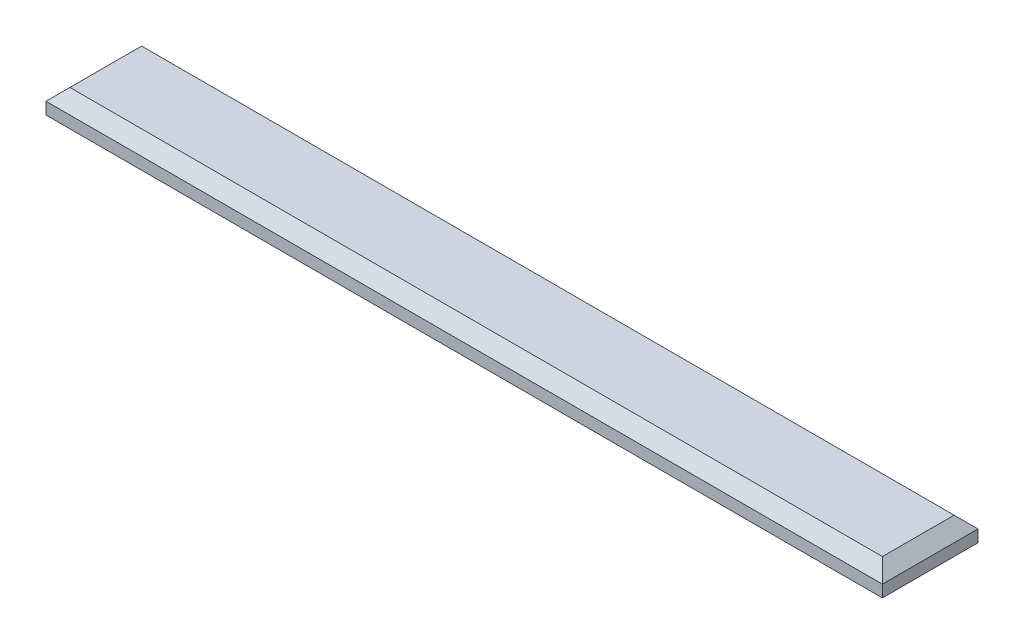
ISO-10303-21;
HEADER;
FILE_DESCRIPTION(('STEP AP214'),'2;1');
FILE_NAME('part.step','',(''),(''),'','','');
FILE_SCHEMA(('AUTOMOTIVE_DESIGN { 1 0 10303 214 1 1 1 1 }'));
ENDSEC;
DATA;
#1=APPLICATION_CONTEXT('core data for automotive mechanical design processes');
#2=APPLICATION_PROTOCOL_DEFINITION('international standard','automotive_design',2000,#1);
#3=PRODUCT_CONTEXT('',#1,'mechanical');
#4=PRODUCT('Part','Part','',(#3));
#5=PRODUCT_RELATED_PRODUCT_CATEGORY('part','',(#4));
#6=PRODUCT_DEFINITION_FORMATION('','',#4);
#7=PRODUCT_DEFINITION_CONTEXT('part definition',#1,'design');
#8=PRODUCT_DEFINITION('design','',#6,#7);
#9=PRODUCT_DEFINITION_SHAPE('','',#8);
#10=(LENGTH_UNIT() NAMED_UNIT(*) SI_UNIT(.MILLI.,.METRE.));
#11=(NAMED_UNIT(*) PLANE_ANGLE_UNIT() SI_UNIT($,.RADIAN.));
#12=(NAMED_UNIT(*) SI_UNIT($,.STERADIAN.) SOLID_ANGLE_UNIT());
#13=UNCERTAINTY_MEASURE_WITH_UNIT(LENGTH_MEASURE(1.E-05),#10,'distance_accuracy_value','');
#14=(GEOMETRIC_REPRESENTATION_CONTEXT(3) GLOBAL_UNCERTAINTY_ASSIGNED_CONTEXT((#13)) GLOBAL_UNIT_ASSIGNED_CONTEXT((#10,
#11,#12)) REPRESENTATION_CONTEXT('',''));
#15=CARTESIAN_POINT('',(0.,0.,0.));
#16=DIRECTION('',(0.,0.,1.));
#17=DIRECTION('',(1.,0.,0.));
#18=AXIS2_PLACEMENT_3D('',#15,#16,#17);
#19=CARTESIAN_POINT('',(0.,2.,0.));
#20=DIRECTION('',(1.,0.,0.));
#21=DIRECTION('',(0.,0.,-1.));
#22=AXIS2_PLACEMENT_3D('',#19,#20,#21);
#23=PLANE('',#22);
#24=DIRECTION('',(0.,-1.,0.));
#25=VECTOR('',#24,1.);
#26=CARTESIAN_POINT('',(0.,2.,0.));
#27=LINE('',#26,#25);
#28=CARTESIAN_POINT('',(0.,0.999999999999999,0.));
#29=VERTEX_POINT('',#28);
#30=CARTESIAN_POINT('',(0.,0.,0.));
#31=VERTEX_POINT('',#30);
#32=EDGE_CURVE('E95',#29,#31,#27,.T.);
#33=ORIENTED_EDGE('',*,*,#32,.F.);
#34=DIRECTION('',(0.,0.,-1.));
#35=VECTOR('',#34,1.);
#36=CARTESIAN_POINT('',(0.,0.999999999999999,0.));
#37=LINE('',#36,#35);
#38=CARTESIAN_POINT('',(0.,0.999999999999999,-8.));
#39=VERTEX_POINT('',#38);
#40=EDGE_CURVE('E11',#29,#39,#37,.T.);
#41=ORIENTED_EDGE('',*,*,#40,.T.);
#42=DIRECTION('',(0.,-1.,0.));
#43=VECTOR('',#42,1.);
#44=CARTESIAN_POINT('',(0.,2.,-8.));
#45=LINE('',#44,#43);
#46=CARTESIAN_POINT('',(0.,0.,-8.));
#47=VERTEX_POINT('',#46);
#48=EDGE_CURVE('E117',#39,#47,#45,.T.);
#49=ORIENTED_EDGE('',*,*,#48,.T.);
#50=DIRECTION('',(0.,0.,1.));
#51=VECTOR('',#50,1.);
#52=CARTESIAN_POINT('',(0.,0.,0.));
#53=LINE('',#52,#51);
#54=EDGE_CURVE('E111',#47,#31,#53,.T.);
#55=ORIENTED_EDGE('',*,*,#54,.T.);
#56=EDGE_LOOP('',(#33,#41,#49,#55));
#57=FACE_BOUND('',#56,.T.);
#58=ADVANCED_FACE('F41',(#57),#23,.F.);
#59=CARTESIAN_POINT('',(0.,2.,0.));
#60=DIRECTION('',(0.,0.,-1.));
#61=DIRECTION('',(-1.,0.,0.));
#62=AXIS2_PLACEMENT_3D('',#59,#60,#61);
#63=PLANE('',#62);
#64=DIRECTION('',(0.,-1.,0.));
#65=VECTOR('',#64,1.);
#66=CARTESIAN_POINT('',(70.,2.,0.));
#67=LINE('',#66,#65);
#68=CARTESIAN_POINT('',(70.,0.999999999999999,0.));
#69=VERTEX_POINT('',#68);
#70=CARTESIAN_POINT('',(70.,0.,0.));
#71=VERTEX_POINT('',#70);
#72=EDGE_CURVE('E105',#69,#71,#67,.T.);
#73=ORIENTED_EDGE('',*,*,#72,.F.);
#74=DIRECTION('',(-1.,0.,0.));
#75=VECTOR('',#74,1.);
#76=CARTESIAN_POINT('',(0.,0.999999999999999,0.));
#77=LINE('',#76,#75);
#78=EDGE_CURVE('E52',#69,#29,#77,.T.);
#79=ORIENTED_EDGE('',*,*,#78,.T.);
#80=ORIENTED_EDGE('',*,*,#32,.T.);
#81=DIRECTION('',(1.,0.,0.));
#82=VECTOR('',#81,1.);
#83=CARTESIAN_POINT('',(0.,0.,0.));
#84=LINE('',#83,#82);
#85=EDGE_CURVE('E98',#31,#71,#84,.T.);
#86=ORIENTED_EDGE('',*,*,#85,.T.);
#87=EDGE_LOOP('',(#73,#79,#80,#86));
#88=FACE_BOUND('',#87,.T.);
#89=ADVANCED_FACE('F97',(#88),#63,.F.);
#90=CARTESIAN_POINT('',(70.,2.,0.));
#91=DIRECTION('',(-1.,0.,0.));
#92=DIRECTION('',(0.,0.,1.));
#93=AXIS2_PLACEMENT_3D('',#90,#91,#92);
#94=PLANE('',#93);
#95=DIRECTION('',(0.,-1.,0.));
#96=VECTOR('',#95,1.);
#97=CARTESIAN_POINT('',(70.,2.,-8.));
#98=LINE('',#97,#96);
#99=CARTESIAN_POINT('',(70.,0.999999999999999,-8.));
#100=VERTEX_POINT('',#99);
#101=CARTESIAN_POINT('',(70.,0.,-8.));
#102=VERTEX_POINT('',#101);
#103=EDGE_CURVE('E132',#100,#102,#98,.T.);
#104=ORIENTED_EDGE('',*,*,#103,.F.);
#105=DIRECTION('',(0.,0.,1.));
#106=VECTOR('',#105,1.);
#107=CARTESIAN_POINT('',(70.,0.999999999999999,0.));
#108=LINE('',#107,#106);
#109=EDGE_CURVE('E67',#100,#69,#108,.T.);
#110=ORIENTED_EDGE('',*,*,#109,.T.);
#111=ORIENTED_EDGE('',*,*,#72,.T.);
#112=DIRECTION('',(0.,0.,-1.));
#113=VECTOR('',#112,1.);
#114=CARTESIAN_POINT('',(70.,0.,0.));
#115=LINE('',#114,#113);
#116=EDGE_CURVE('E113',#71,#102,#115,.T.);
#117=ORIENTED_EDGE('',*,*,#116,.T.);
#118=EDGE_LOOP('',(#104,#110,#111,#117));
#119=FACE_BOUND('',#118,.T.);
#120=ADVANCED_FACE('F182',(#119),#94,.F.);
#121=CARTESIAN_POINT('',(0.,2.,-8.));
#122=DIRECTION('',(0.,0.,1.));
#123=DIRECTION('',(1.,0.,0.));
#124=AXIS2_PLACEMENT_3D('',#121,#122,#123);
#125=PLANE('',#124);
#126=ORIENTED_EDGE('',*,*,#48,.F.);
#127=DIRECTION('',(1.,0.,0.));
#128=VECTOR('',#127,1.);
#129=CARTESIAN_POINT('',(0.,0.999999999999999,-8.));
#130=LINE('',#129,#128);
#131=EDGE_CURVE('E149',#39,#100,#130,.T.);
#132=ORIENTED_EDGE('',*,*,#131,.T.);
#133=ORIENTED_EDGE('',*,*,#103,.T.);
#134=DIRECTION('',(-1.,0.,0.));
#135=VECTOR('',#134,1.);
#136=CARTESIAN_POINT('',(0.,0.,-8.));
#137=LINE('',#136,#135);
#138=EDGE_CURVE('E127',#102,#47,#137,.T.);
#139=ORIENTED_EDGE('',*,*,#138,.T.);
#140=EDGE_LOOP('',(#126,#132,#133,#139));
#141=FACE_BOUND('',#140,.T.);
#142=ADVANCED_FACE('F181',(#141),#125,.F.);
#143=CARTESIAN_POINT('',(0.,2.,0.));
#144=DIRECTION('',(0.,-1.,0.));
#145=DIRECTION('',(0.,0.,-1.));
#146=AXIS2_PLACEMENT_3D('',#143,#144,#145);
#147=PLANE('',#146);
#148=DIRECTION('',(0.,0.,-1.));
#149=VECTOR('',#148,1.);
#150=CARTESIAN_POINT('',(69.,2.,0.));
#151=LINE('',#150,#149);
#152=CARTESIAN_POINT('',(69.,2.,-0.999999999999994));
#153=VERTEX_POINT('',#152);
#154=CARTESIAN_POINT('',(69.,2.,-7.00000000000001));
#155=VERTEX_POINT('',#154);
#156=EDGE_CURVE('E142',#153,#155,#151,.T.);
#157=ORIENTED_EDGE('',*,*,#156,.T.);
#158=DIRECTION('',(-1.,0.,0.));
#159=VECTOR('',#158,1.);
#160=CARTESIAN_POINT('',(0.,2.,-7.00000000000001));
#161=LINE('',#160,#159);
#162=CARTESIAN_POINT('',(0.999999999999997,2.,-7.00000000000001));
#163=VERTEX_POINT('',#162);
#164=EDGE_CURVE('E145',#155,#163,#161,.T.);
#165=ORIENTED_EDGE('',*,*,#164,.T.);
#166=DIRECTION('',(0.,0.,1.));
#167=VECTOR('',#166,1.);
#168=CARTESIAN_POINT('',(0.999999999999994,2.,0.));
#169=LINE('',#168,#167);
#170=CARTESIAN_POINT('',(0.999999999999994,2.,-0.999999999999994));
#171=VERTEX_POINT('',#170);
#172=EDGE_CURVE('E104',#163,#171,#169,.T.);
#173=ORIENTED_EDGE('',*,*,#172,.T.);
#174=DIRECTION('',(1.,0.,0.));
#175=VECTOR('',#174,1.);
#176=CARTESIAN_POINT('',(0.,2.,-0.999999999999994));
#177=LINE('',#176,#175);
#178=EDGE_CURVE('E139',#171,#153,#177,.T.);
#179=ORIENTED_EDGE('',*,*,#178,.T.);
#180=EDGE_LOOP('',(#157,#165,#173,#179));
#181=FACE_BOUND('',#180,.T.);
#182=ADVANCED_FACE('F174',(#181),#147,.F.);
#183=CARTESIAN_POINT('',(0.,0.,0.));
#184=DIRECTION('',(0.,-1.,0.));
#185=DIRECTION('',(0.,0.,-1.));
#186=AXIS2_PLACEMENT_3D('',#183,#184,#185);
#187=PLANE('',#186);
#188=ORIENTED_EDGE('',*,*,#54,.F.);
#189=ORIENTED_EDGE('',*,*,#138,.F.);
#190=ORIENTED_EDGE('',*,*,#116,.F.);
#191=ORIENTED_EDGE('',*,*,#85,.F.);
#192=EDGE_LOOP('',(#188,#189,#190,#191));
#193=FACE_BOUND('',#192,.T.);
#194=ADVANCED_FACE('F109',(#193),#187,.T.);
#195=CARTESIAN_POINT('',(0.,2.,-0.999999999999994));
#196=DIRECTION('',(0.,-0.707106781186545,-0.70710678118655));
#197=DIRECTION('',(1.,0.,0.));
#198=AXIS2_PLACEMENT_3D('',#195,#196,#197);
#199=PLANE('',#198);
#200=DIRECTION('',(0.577350269189625,0.577350269189628,-0.577350269189624));
#201=VECTOR('',#200,1.);
#202=CARTESIAN_POINT('',(0.666666666666664,1.66666666666667,-0.666666666666664));
#203=LINE('',#202,#201);
#204=EDGE_CURVE('E123',#29,#171,#203,.T.);
#205=ORIENTED_EDGE('',*,*,#204,.F.);
#206=ORIENTED_EDGE('',*,*,#78,.F.);
#207=DIRECTION('',(-0.577350269189627,0.577350269189627,-0.577350269189623));
#208=VECTOR('',#207,1.);
#209=CARTESIAN_POINT('',(45.9999999999999,25.0000000000001,-23.9999999999999));
#210=LINE('',#209,#208);
#211=EDGE_CURVE('E46',#153,#69,#210,.F.);
#212=ORIENTED_EDGE('',*,*,#211,.F.);
#213=ORIENTED_EDGE('',*,*,#178,.F.);
#214=EDGE_LOOP('',(#205,#206,#212,#213));
#215=FACE_BOUND('',#214,.T.);
#216=ADVANCED_FACE('F44',(#215),#199,.F.);
#217=CARTESIAN_POINT('',(69.,2.,0.));
#218=DIRECTION('',(-0.707106781186547,-0.707106781186547,0.));
#219=DIRECTION('',(0.,0.,-1.));
#220=AXIS2_PLACEMENT_3D('',#217,#218,#219);
#221=PLANE('',#220);
#222=ORIENTED_EDGE('',*,*,#211,.T.);
#223=ORIENTED_EDGE('',*,*,#109,.F.);
#224=DIRECTION('',(-0.577350269189627,0.577350269189627,0.577350269189623));
#225=VECTOR('',#224,1.);
#226=CARTESIAN_POINT('',(66.6666666666667,4.33333333333333,-4.66666666666669));
#227=LINE('',#226,#225);
#228=EDGE_CURVE('E160',#155,#100,#227,.F.);
#229=ORIENTED_EDGE('',*,*,#228,.F.);
#230=ORIENTED_EDGE('',*,*,#156,.F.);
#231=EDGE_LOOP('',(#222,#223,#229,#230));
#232=FACE_BOUND('',#231,.T.);
#233=ADVANCED_FACE('F206',(#232),#221,.F.);
#234=CARTESIAN_POINT('',(0.999999999999994,2.,0.));
#235=DIRECTION('',(0.70710678118655,-0.707106781186545,0.));
#236=DIRECTION('',(0.,0.,1.));
#237=AXIS2_PLACEMENT_3D('',#234,#235,#236);
#238=PLANE('',#237);
#239=ORIENTED_EDGE('',*,*,#204,.T.);
#240=ORIENTED_EDGE('',*,*,#172,.F.);
#241=DIRECTION('',(-0.577350269189624,-0.577350269189629,-0.577350269189625));
#242=VECTOR('',#241,1.);
#243=CARTESIAN_POINT('',(3.33333333333332,4.33333333333334,-4.66666666666668));
#244=LINE('',#243,#242);
#245=EDGE_CURVE('E157',#39,#163,#244,.F.);
#246=ORIENTED_EDGE('',*,*,#245,.F.);
#247=ORIENTED_EDGE('',*,*,#40,.F.);
#248=EDGE_LOOP('',(#239,#240,#246,#247));
#249=FACE_BOUND('',#248,.T.);
#250=ADVANCED_FACE('F167',(#249),#238,.F.);
#251=CARTESIAN_POINT('',(0.,2.,-7.00000000000001));
#252=DIRECTION('',(0.,-0.707106781186545,0.70710678118655));
#253=DIRECTION('',(-1.,0.,0.));
#254=AXIS2_PLACEMENT_3D('',#251,#252,#253);
#255=PLANE('',#254);
#256=ORIENTED_EDGE('',*,*,#228,.T.);
#257=ORIENTED_EDGE('',*,*,#131,.F.);
#258=ORIENTED_EDGE('',*,*,#245,.T.);
#259=ORIENTED_EDGE('',*,*,#164,.F.);
#260=EDGE_LOOP('',(#256,#257,#258,#259));
#261=FACE_BOUND('',#260,.T.);
#262=ADVANCED_FACE('F178',(#261),#255,.F.);
#263=CLOSED_SHELL('',(#58,#89,#120,#142,#182,#194,#216,#233,#250,#262));
#264=MANIFOLD_SOLID_BREP('B2',#263);
#265=ADVANCED_BREP_SHAPE_REPRESENTATION('',(#18,#264),#14);
#266=SHAPE_DEFINITION_REPRESENTATION(#9,#265);
ENDSEC;
END-ISO-10303-21;
